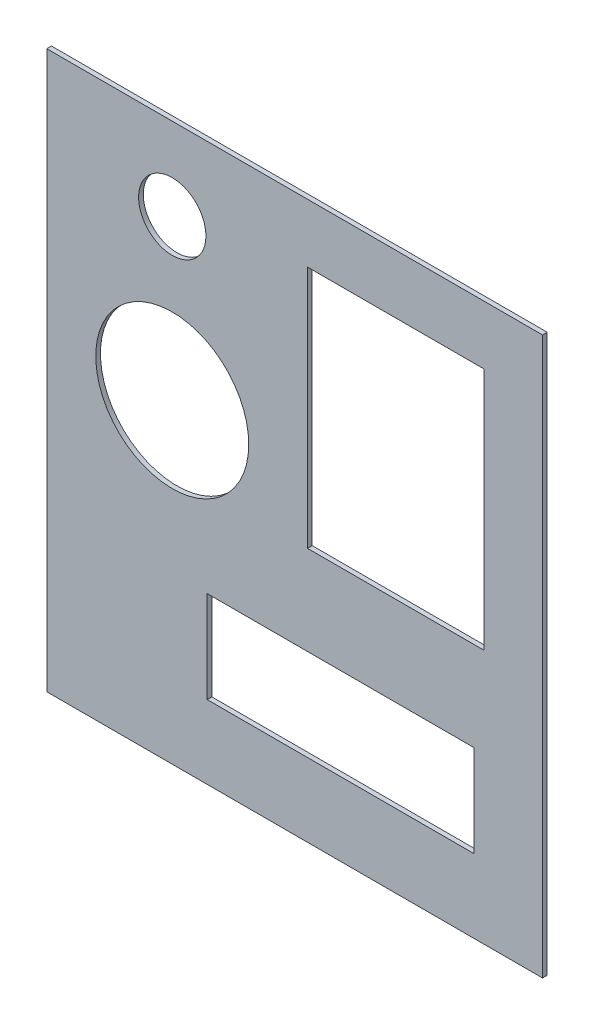
ISO-10303-21;
HEADER;
FILE_DESCRIPTION(('STEP AP214'),'2;1');
FILE_NAME('part.step','',(''),(''),'','','');
FILE_SCHEMA(('AUTOMOTIVE_DESIGN { 1 0 10303 214 1 1 1 1 }'));
ENDSEC;
DATA;
#1=APPLICATION_CONTEXT('core data for automotive mechanical design processes');
#2=APPLICATION_PROTOCOL_DEFINITION('international standard','automotive_design',2000,#1);
#3=PRODUCT_CONTEXT('',#1,'mechanical');
#4=PRODUCT('Part','Part','',(#3));
#5=PRODUCT_RELATED_PRODUCT_CATEGORY('part','',(#4));
#6=PRODUCT_DEFINITION_FORMATION('','',#4);
#7=PRODUCT_DEFINITION_CONTEXT('part definition',#1,'design');
#8=PRODUCT_DEFINITION('design','',#6,#7);
#9=PRODUCT_DEFINITION_SHAPE('','',#8);
#10=(LENGTH_UNIT() NAMED_UNIT(*) SI_UNIT(.MILLI.,.METRE.));
#11=(NAMED_UNIT(*) PLANE_ANGLE_UNIT() SI_UNIT($,.RADIAN.));
#12=(NAMED_UNIT(*) SI_UNIT($,.STERADIAN.) SOLID_ANGLE_UNIT());
#13=UNCERTAINTY_MEASURE_WITH_UNIT(LENGTH_MEASURE(1.E-05),#10,'distance_accuracy_value','');
#14=(GEOMETRIC_REPRESENTATION_CONTEXT(3) GLOBAL_UNCERTAINTY_ASSIGNED_CONTEXT((#13)) GLOBAL_UNIT_ASSIGNED_CONTEXT((#10,
#11,#12)) REPRESENTATION_CONTEXT('',''));
#15=CARTESIAN_POINT('',(0.,0.,0.));
#16=DIRECTION('',(0.,0.,1.));
#17=DIRECTION('',(1.,0.,0.));
#18=AXIS2_PLACEMENT_3D('',#15,#16,#17);
#19=CARTESIAN_POINT('',(-64.29375,-72.23125,1.21412));
#20=DIRECTION('',(-1.,0.,0.));
#21=DIRECTION('',(0.,0.,1.));
#22=AXIS2_PLACEMENT_3D('',#19,#20,#21);
#23=PLANE('',#22);
#24=DIRECTION('',(0.,1.,0.));
#25=VECTOR('',#24,1.);
#26=CARTESIAN_POINT('',(-64.29375,-72.23125,0.));
#27=LINE('',#26,#25);
#28=CARTESIAN_POINT('',(-64.29375,-72.23125,0.));
#29=VERTEX_POINT('',#28);
#30=CARTESIAN_POINT('',(-64.29375,72.23125,0.));
#31=VERTEX_POINT('',#30);
#32=EDGE_CURVE('E240',#29,#31,#27,.T.);
#33=ORIENTED_EDGE('',*,*,#32,.F.);
#34=DIRECTION('',(0.,0.,-1.));
#35=VECTOR('',#34,1.);
#36=CARTESIAN_POINT('',(-64.29375,-72.23125,1.21412));
#37=LINE('',#36,#35);
#38=CARTESIAN_POINT('',(-64.29375,-72.23125,1.21412));
#39=VERTEX_POINT('',#38);
#40=EDGE_CURVE('E11',#39,#29,#37,.T.);
#41=ORIENTED_EDGE('',*,*,#40,.F.);
#42=DIRECTION('',(0.,1.,0.));
#43=VECTOR('',#42,1.);
#44=CARTESIAN_POINT('',(-64.29375,-72.23125,1.21412));
#45=LINE('',#44,#43);
#46=CARTESIAN_POINT('',(-64.29375,72.23125,1.21412));
#47=VERTEX_POINT('',#46);
#48=EDGE_CURVE('E244',#39,#47,#45,.T.);
#49=ORIENTED_EDGE('',*,*,#48,.T.);
#50=DIRECTION('',(0.,0.,-1.));
#51=VECTOR('',#50,1.);
#52=CARTESIAN_POINT('',(-64.29375,72.23125,1.21412));
#53=LINE('',#52,#51);
#54=EDGE_CURVE('E46',#47,#31,#53,.T.);
#55=ORIENTED_EDGE('',*,*,#54,.T.);
#56=EDGE_LOOP('',(#33,#41,#49,#55));
#57=FACE_BOUND('',#56,.T.);
#58=ADVANCED_FACE('F43',(#57),#23,.T.);
#59=CARTESIAN_POINT('',(-64.29375,-72.23125,1.21412));
#60=DIRECTION('',(0.,1.,0.));
#61=DIRECTION('',(0.,0.,1.));
#62=AXIS2_PLACEMENT_3D('',#59,#60,#61);
#63=PLANE('',#62);
#64=DIRECTION('',(1.,0.,0.));
#65=VECTOR('',#64,1.);
#66=CARTESIAN_POINT('',(-64.29375,-72.23125,0.));
#67=LINE('',#66,#65);
#68=CARTESIAN_POINT('',(64.29375,-72.23125,0.));
#69=VERTEX_POINT('',#68);
#70=EDGE_CURVE('E78',#29,#69,#67,.T.);
#71=ORIENTED_EDGE('',*,*,#70,.T.);
#72=DIRECTION('',(0.,0.,-1.));
#73=VECTOR('',#72,1.);
#74=CARTESIAN_POINT('',(64.29375,-72.23125,1.21412));
#75=LINE('',#74,#73);
#76=CARTESIAN_POINT('',(64.29375,-72.23125,1.21412));
#77=VERTEX_POINT('',#76);
#78=EDGE_CURVE('E53',#77,#69,#75,.T.);
#79=ORIENTED_EDGE('',*,*,#78,.F.);
#80=DIRECTION('',(1.,0.,0.));
#81=VECTOR('',#80,1.);
#82=CARTESIAN_POINT('',(-64.29375,-72.23125,1.21412));
#83=LINE('',#82,#81);
#84=EDGE_CURVE('E253',#39,#77,#83,.T.);
#85=ORIENTED_EDGE('',*,*,#84,.F.);
#86=ORIENTED_EDGE('',*,*,#40,.T.);
#87=EDGE_LOOP('',(#71,#79,#85,#86));
#88=FACE_BOUND('',#87,.T.);
#89=ADVANCED_FACE('F282',(#88),#63,.F.);
#90=CARTESIAN_POINT('',(64.29375,-72.23125,1.21412));
#91=DIRECTION('',(-1.,0.,0.));
#92=DIRECTION('',(0.,0.,1.));
#93=AXIS2_PLACEMENT_3D('',#90,#91,#92);
#94=PLANE('',#93);
#95=DIRECTION('',(0.,1.,0.));
#96=VECTOR('',#95,1.);
#97=CARTESIAN_POINT('',(64.29375,-72.23125,0.));
#98=LINE('',#97,#96);
#99=CARTESIAN_POINT('',(64.29375,72.23125,0.));
#100=VERTEX_POINT('',#99);
#101=EDGE_CURVE('E263',#69,#100,#98,.T.);
#102=ORIENTED_EDGE('',*,*,#101,.T.);
#103=DIRECTION('',(0.,0.,-1.));
#104=VECTOR('',#103,1.);
#105=CARTESIAN_POINT('',(64.29375,72.23125,1.21412));
#106=LINE('',#105,#104);
#107=CARTESIAN_POINT('',(64.29375,72.23125,1.21412));
#108=VERTEX_POINT('',#107);
#109=EDGE_CURVE('E270',#108,#100,#106,.T.);
#110=ORIENTED_EDGE('',*,*,#109,.F.);
#111=DIRECTION('',(0.,1.,0.));
#112=VECTOR('',#111,1.);
#113=CARTESIAN_POINT('',(64.29375,-72.23125,1.21412));
#114=LINE('',#113,#112);
#115=EDGE_CURVE('E250',#77,#108,#114,.T.);
#116=ORIENTED_EDGE('',*,*,#115,.F.);
#117=ORIENTED_EDGE('',*,*,#78,.T.);
#118=EDGE_LOOP('',(#102,#110,#116,#117));
#119=FACE_BOUND('',#118,.T.);
#120=ADVANCED_FACE('F280',(#119),#94,.F.);
#121=CARTESIAN_POINT('',(-64.29375,72.23125,1.21412));
#122=DIRECTION('',(0.,1.,0.));
#123=DIRECTION('',(0.,0.,1.));
#124=AXIS2_PLACEMENT_3D('',#121,#122,#123);
#125=PLANE('',#124);
#126=DIRECTION('',(1.,0.,0.));
#127=VECTOR('',#126,1.);
#128=CARTESIAN_POINT('',(-64.29375,72.23125,0.));
#129=LINE('',#128,#127);
#130=EDGE_CURVE('E259',#31,#100,#129,.T.);
#131=ORIENTED_EDGE('',*,*,#130,.F.);
#132=ORIENTED_EDGE('',*,*,#54,.F.);
#133=DIRECTION('',(1.,0.,0.));
#134=VECTOR('',#133,1.);
#135=CARTESIAN_POINT('',(-64.29375,72.23125,1.21412));
#136=LINE('',#135,#134);
#137=EDGE_CURVE('E247',#47,#108,#136,.T.);
#138=ORIENTED_EDGE('',*,*,#137,.T.);
#139=ORIENTED_EDGE('',*,*,#109,.T.);
#140=EDGE_LOOP('',(#131,#132,#138,#139));
#141=FACE_BOUND('',#140,.T.);
#142=ADVANCED_FACE('F275',(#141),#125,.T.);
#143=CARTESIAN_POINT('',(0.,0.,1.21412));
#144=DIRECTION('',(0.,0.,-1.));
#145=DIRECTION('',(-1.,0.,0.));
#146=AXIS2_PLACEMENT_3D('',#143,#144,#145);
#147=PLANE('',#146);
#148=CARTESIAN_POINT('',(-31.75,9.525,1.21412));
#149=DIRECTION('',(0.,0.,1.));
#150=DIRECTION('',(1.,0.,0.));
#151=AXIS2_PLACEMENT_3D('',#148,#149,#150);
#152=CIRCLE('',#151,19.84375);
#153=CARTESIAN_POINT('',(-11.90625,9.525,1.21412));
#154=VERTEX_POINT('',#153);
#155=EDGE_CURVE('E228',#154,#154,#152,.T.);
#156=ORIENTED_EDGE('',*,*,#155,.F.);
#157=EDGE_LOOP('',(#156));
#158=FACE_BOUND('',#157,.T.);
#159=CARTESIAN_POINT('',(-31.75,50.8,1.21412));
#160=DIRECTION('',(0.,0.,1.));
#161=DIRECTION('',(1.,0.,0.));
#162=AXIS2_PLACEMENT_3D('',#159,#160,#161);
#163=CIRCLE('',#162,8.73125);
#164=CARTESIAN_POINT('',(-23.01875,50.8,1.21412));
#165=VERTEX_POINT('',#164);
#166=EDGE_CURVE('E232',#165,#165,#163,.T.);
#167=ORIENTED_EDGE('',*,*,#166,.F.);
#168=EDGE_LOOP('',(#167));
#169=FACE_BOUND('',#168,.T.);
#170=ORIENTED_EDGE('',*,*,#48,.F.);
#171=ORIENTED_EDGE('',*,*,#84,.T.);
#172=ORIENTED_EDGE('',*,*,#115,.T.);
#173=ORIENTED_EDGE('',*,*,#137,.F.);
#174=EDGE_LOOP('',(#170,#171,#172,#173));
#175=FACE_BOUND('',#174,.T.);
#176=DIRECTION('',(0.,-1.,0.));
#177=VECTOR('',#176,1.);
#178=CARTESIAN_POINT('',(3.33375000000001,56.99125,1.21412));
#179=LINE('',#178,#177);
#180=CARTESIAN_POINT('',(3.33375000000001,56.99125,1.21412));
#181=VERTEX_POINT('',#180);
#182=CARTESIAN_POINT('',(3.33375000000001,-6.19125000000001,1.21412));
#183=VERTEX_POINT('',#182);
#184=EDGE_CURVE('E200',#181,#183,#179,.T.);
#185=ORIENTED_EDGE('',*,*,#184,.F.);
#186=DIRECTION('',(-1.,0.,0.));
#187=VECTOR('',#186,1.);
#188=CARTESIAN_POINT('',(49.05375,56.99125,1.21412));
#189=LINE('',#188,#187);
#190=CARTESIAN_POINT('',(49.05375,56.99125,1.21412));
#191=VERTEX_POINT('',#190);
#192=EDGE_CURVE('E184',#191,#181,#189,.T.);
#193=ORIENTED_EDGE('',*,*,#192,.F.);
#194=DIRECTION('',(0.,1.,0.));
#195=VECTOR('',#194,1.);
#196=CARTESIAN_POINT('',(49.05375,-6.19125000000001,1.21412));
#197=LINE('',#196,#195);
#198=CARTESIAN_POINT('',(49.05375,-6.19125000000001,1.21412));
#199=VERTEX_POINT('',#198);
#200=EDGE_CURVE('E190',#199,#191,#197,.T.);
#201=ORIENTED_EDGE('',*,*,#200,.F.);
#202=DIRECTION('',(1.,0.,0.));
#203=VECTOR('',#202,1.);
#204=CARTESIAN_POINT('',(3.33375000000001,-6.19125000000001,1.21412));
#205=LINE('',#204,#203);
#206=EDGE_CURVE('E195',#183,#199,#205,.T.);
#207=ORIENTED_EDGE('',*,*,#206,.F.);
#208=EDGE_LOOP('',(#185,#193,#201,#207));
#209=FACE_BOUND('',#208,.T.);
#210=DIRECTION('',(0.,-1.,0.));
#211=VECTOR('',#210,1.);
#212=CARTESIAN_POINT('',(-22.70125,-29.36875,1.21412));
#213=LINE('',#212,#211);
#214=CARTESIAN_POINT('',(-22.70125,-29.36875,1.21412));
#215=VERTEX_POINT('',#214);
#216=CARTESIAN_POINT('',(-22.70125,-53.18125,1.21412));
#217=VERTEX_POINT('',#216);
#218=EDGE_CURVE('E144',#215,#217,#213,.T.);
#219=ORIENTED_EDGE('',*,*,#218,.F.);
#220=DIRECTION('',(-1.,0.,0.));
#221=VECTOR('',#220,1.);
#222=CARTESIAN_POINT('',(46.51375,-29.36875,1.21412));
#223=LINE('',#222,#221);
#224=CARTESIAN_POINT('',(46.51375,-29.36875,1.21412));
#225=VERTEX_POINT('',#224);
#226=EDGE_CURVE('E181',#225,#215,#223,.T.);
#227=ORIENTED_EDGE('',*,*,#226,.F.);
#228=DIRECTION('',(0.,1.,0.));
#229=VECTOR('',#228,1.);
#230=CARTESIAN_POINT('',(46.51375,-53.18125,1.21412));
#231=LINE('',#230,#229);
#232=CARTESIAN_POINT('',(46.51375,-53.18125,1.21412));
#233=VERTEX_POINT('',#232);
#234=EDGE_CURVE('E150',#233,#225,#231,.T.);
#235=ORIENTED_EDGE('',*,*,#234,.F.);
#236=DIRECTION('',(1.,0.,0.));
#237=VECTOR('',#236,1.);
#238=CARTESIAN_POINT('',(-22.70125,-53.18125,1.21412));
#239=LINE('',#238,#237);
#240=EDGE_CURVE('E149',#217,#233,#239,.T.);
#241=ORIENTED_EDGE('',*,*,#240,.F.);
#242=EDGE_LOOP('',(#219,#227,#235,#241));
#243=FACE_BOUND('',#242,.T.);
#244=ADVANCED_FACE('F284',(#158,#169,#175,#209,#243),#147,.F.);
#245=CARTESIAN_POINT('',(0.,0.,0.));
#246=DIRECTION('',(0.,0.,-1.));
#247=DIRECTION('',(-1.,0.,0.));
#248=AXIS2_PLACEMENT_3D('',#245,#246,#247);
#249=PLANE('',#248);
#250=CARTESIAN_POINT('',(-31.75,9.525,0.));
#251=DIRECTION('',(0.,0.,1.));
#252=DIRECTION('',(1.,0.,0.));
#253=AXIS2_PLACEMENT_3D('',#250,#251,#252);
#254=CIRCLE('',#253,19.84375);
#255=CARTESIAN_POINT('',(-11.90625,9.525,0.));
#256=VERTEX_POINT('',#255);
#257=EDGE_CURVE('E216',#256,#256,#254,.T.);
#258=ORIENTED_EDGE('',*,*,#257,.T.);
#259=EDGE_LOOP('',(#258));
#260=FACE_BOUND('',#259,.T.);
#261=CARTESIAN_POINT('',(-31.75,50.8,0.));
#262=DIRECTION('',(0.,0.,1.));
#263=DIRECTION('',(1.,0.,0.));
#264=AXIS2_PLACEMENT_3D('',#261,#262,#263);
#265=CIRCLE('',#264,8.73125);
#266=CARTESIAN_POINT('',(-23.01875,50.8,0.));
#267=VERTEX_POINT('',#266);
#268=EDGE_CURVE('E236',#267,#267,#265,.T.);
#269=ORIENTED_EDGE('',*,*,#268,.T.);
#270=EDGE_LOOP('',(#269));
#271=FACE_BOUND('',#270,.T.);
#272=ORIENTED_EDGE('',*,*,#32,.T.);
#273=ORIENTED_EDGE('',*,*,#130,.T.);
#274=ORIENTED_EDGE('',*,*,#101,.F.);
#275=ORIENTED_EDGE('',*,*,#70,.F.);
#276=EDGE_LOOP('',(#272,#273,#274,#275));
#277=FACE_BOUND('',#276,.T.);
#278=DIRECTION('',(-1.,0.,0.));
#279=VECTOR('',#278,1.);
#280=CARTESIAN_POINT('',(49.05375,56.99125,0.));
#281=LINE('',#280,#279);
#282=CARTESIAN_POINT('',(49.05375,56.99125,0.));
#283=VERTEX_POINT('',#282);
#284=CARTESIAN_POINT('',(3.33375000000001,56.99125,0.));
#285=VERTEX_POINT('',#284);
#286=EDGE_CURVE('E199',#283,#285,#281,.T.);
#287=ORIENTED_EDGE('',*,*,#286,.T.);
#288=DIRECTION('',(0.,-1.,0.));
#289=VECTOR('',#288,1.);
#290=CARTESIAN_POINT('',(3.33375000000001,56.99125,0.));
#291=LINE('',#290,#289);
#292=CARTESIAN_POINT('',(3.33375000000001,-6.19125000000001,0.));
#293=VERTEX_POINT('',#292);
#294=EDGE_CURVE('E204',#285,#293,#291,.T.);
#295=ORIENTED_EDGE('',*,*,#294,.T.);
#296=DIRECTION('',(1.,0.,0.));
#297=VECTOR('',#296,1.);
#298=CARTESIAN_POINT('',(3.33375000000001,-6.19125000000001,0.));
#299=LINE('',#298,#297);
#300=CARTESIAN_POINT('',(49.05375,-6.19125000000001,0.));
#301=VERTEX_POINT('',#300);
#302=EDGE_CURVE('E208',#293,#301,#299,.T.);
#303=ORIENTED_EDGE('',*,*,#302,.T.);
#304=DIRECTION('',(0.,1.,0.));
#305=VECTOR('',#304,1.);
#306=CARTESIAN_POINT('',(49.05375,-6.19125000000001,0.));
#307=LINE('',#306,#305);
#308=EDGE_CURVE('E212',#301,#283,#307,.T.);
#309=ORIENTED_EDGE('',*,*,#308,.T.);
#310=EDGE_LOOP('',(#287,#295,#303,#309));
#311=FACE_BOUND('',#310,.T.);
#312=DIRECTION('',(-1.,0.,0.));
#313=VECTOR('',#312,1.);
#314=CARTESIAN_POINT('',(46.51375,-29.36875,0.));
#315=LINE('',#314,#313);
#316=CARTESIAN_POINT('',(46.51375,-29.36875,0.));
#317=VERTEX_POINT('',#316);
#318=CARTESIAN_POINT('',(-22.70125,-29.36875,0.));
#319=VERTEX_POINT('',#318);
#320=EDGE_CURVE('E164',#317,#319,#315,.T.);
#321=ORIENTED_EDGE('',*,*,#320,.T.);
#322=DIRECTION('',(0.,-1.,0.));
#323=VECTOR('',#322,1.);
#324=CARTESIAN_POINT('',(-22.70125,-29.36875,0.));
#325=LINE('',#324,#323);
#326=CARTESIAN_POINT('',(-22.70125,-53.18125,0.));
#327=VERTEX_POINT('',#326);
#328=EDGE_CURVE('E141',#319,#327,#325,.T.);
#329=ORIENTED_EDGE('',*,*,#328,.T.);
#330=DIRECTION('',(1.,0.,0.));
#331=VECTOR('',#330,1.);
#332=CARTESIAN_POINT('',(-22.70125,-53.18125,0.));
#333=LINE('',#332,#331);
#334=CARTESIAN_POINT('',(46.51375,-53.18125,0.));
#335=VERTEX_POINT('',#334);
#336=EDGE_CURVE('E153',#327,#335,#333,.T.);
#337=ORIENTED_EDGE('',*,*,#336,.T.);
#338=DIRECTION('',(0.,1.,0.));
#339=VECTOR('',#338,1.);
#340=CARTESIAN_POINT('',(46.51375,-53.18125,0.));
#341=LINE('',#340,#339);
#342=EDGE_CURVE('E160',#335,#317,#341,.T.);
#343=ORIENTED_EDGE('',*,*,#342,.T.);
#344=EDGE_LOOP('',(#321,#329,#337,#343));
#345=FACE_BOUND('',#344,.T.);
#346=ADVANCED_FACE('F163',(#260,#271,#277,#311,#345),#249,.T.);
#347=CARTESIAN_POINT('',(-31.75,50.8,0.));
#348=DIRECTION('',(0.,0.,1.));
#349=DIRECTION('',(1.,0.,0.));
#350=AXIS2_PLACEMENT_3D('',#347,#348,#349);
#351=CYLINDRICAL_SURFACE('',#350,8.73125);
#352=ORIENTED_EDGE('',*,*,#268,.F.);
#353=EDGE_LOOP('',(#352));
#354=FACE_BOUND('',#353,.T.);
#355=ORIENTED_EDGE('',*,*,#166,.T.);
#356=EDGE_LOOP('',(#355));
#357=FACE_BOUND('',#356,.T.);
#358=ADVANCED_FACE('F336',(#354,#357),#351,.F.);
#359=CARTESIAN_POINT('',(-31.75,9.525,0.));
#360=DIRECTION('',(0.,0.,1.));
#361=DIRECTION('',(1.,0.,0.));
#362=AXIS2_PLACEMENT_3D('',#359,#360,#361);
#363=CYLINDRICAL_SURFACE('',#362,19.84375);
#364=ORIENTED_EDGE('',*,*,#257,.F.);
#365=EDGE_LOOP('',(#364));
#366=FACE_BOUND('',#365,.T.);
#367=ORIENTED_EDGE('',*,*,#155,.T.);
#368=EDGE_LOOP('',(#367));
#369=FACE_BOUND('',#368,.T.);
#370=ADVANCED_FACE('F339',(#366,#369),#363,.F.);
#371=CARTESIAN_POINT('',(3.33375000000001,56.99125,-85.0905923486845));
#372=DIRECTION('',(-1.,0.,0.));
#373=DIRECTION('',(0.,0.,1.));
#374=AXIS2_PLACEMENT_3D('',#371,#372,#373);
#375=PLANE('',#374);
#376=ORIENTED_EDGE('',*,*,#294,.F.);
#377=DIRECTION('',(0.,0.,1.));
#378=VECTOR('',#377,1.);
#379=CARTESIAN_POINT('',(3.33375000000001,56.99125,-85.0905923486845));
#380=LINE('',#379,#378);
#381=EDGE_CURVE('E173',#285,#181,#380,.T.);
#382=ORIENTED_EDGE('',*,*,#381,.T.);
#383=ORIENTED_EDGE('',*,*,#184,.T.);
#384=DIRECTION('',(0.,0.,1.));
#385=VECTOR('',#384,1.);
#386=CARTESIAN_POINT('',(3.33375000000001,-6.19125000000001,-85.0905923486845));
#387=LINE('',#386,#385);
#388=EDGE_CURVE('E194',#293,#183,#387,.T.);
#389=ORIENTED_EDGE('',*,*,#388,.F.);
#390=EDGE_LOOP('',(#376,#382,#383,#389));
#391=FACE_BOUND('',#390,.T.);
#392=ADVANCED_FACE('F346',(#391),#375,.F.);
#393=CARTESIAN_POINT('',(49.05375,56.99125,-85.0905923486845));
#394=DIRECTION('',(0.,1.,0.));
#395=DIRECTION('',(0.,0.,1.));
#396=AXIS2_PLACEMENT_3D('',#393,#394,#395);
#397=PLANE('',#396);
#398=ORIENTED_EDGE('',*,*,#286,.F.);
#399=DIRECTION('',(0.,0.,1.));
#400=VECTOR('',#399,1.);
#401=CARTESIAN_POINT('',(49.05375,56.99125,-85.0905923486845));
#402=LINE('',#401,#400);
#403=EDGE_CURVE('E189',#283,#191,#402,.T.);
#404=ORIENTED_EDGE('',*,*,#403,.T.);
#405=ORIENTED_EDGE('',*,*,#192,.T.);
#406=ORIENTED_EDGE('',*,*,#381,.F.);
#407=EDGE_LOOP('',(#398,#404,#405,#406));
#408=FACE_BOUND('',#407,.T.);
#409=ADVANCED_FACE('F367',(#408),#397,.F.);
#410=CARTESIAN_POINT('',(49.05375,-6.19125000000001,-85.0905923486845));
#411=DIRECTION('',(1.,0.,0.));
#412=DIRECTION('',(0.,0.,-1.));
#413=AXIS2_PLACEMENT_3D('',#410,#411,#412);
#414=PLANE('',#413);
#415=ORIENTED_EDGE('',*,*,#308,.F.);
#416=DIRECTION('',(0.,0.,1.));
#417=VECTOR('',#416,1.);
#418=CARTESIAN_POINT('',(49.05375,-6.19125000000001,-85.0905923486845));
#419=LINE('',#418,#417);
#420=EDGE_CURVE('E188',#301,#199,#419,.T.);
#421=ORIENTED_EDGE('',*,*,#420,.T.);
#422=ORIENTED_EDGE('',*,*,#200,.T.);
#423=ORIENTED_EDGE('',*,*,#403,.F.);
#424=EDGE_LOOP('',(#415,#421,#422,#423));
#425=FACE_BOUND('',#424,.T.);
#426=ADVANCED_FACE('F375',(#425),#414,.F.);
#427=CARTESIAN_POINT('',(3.33375000000001,-6.19125000000001,-85.0905923486845));
#428=DIRECTION('',(0.,-1.,0.));
#429=DIRECTION('',(0.,0.,-1.));
#430=AXIS2_PLACEMENT_3D('',#427,#428,#429);
#431=PLANE('',#430);
#432=ORIENTED_EDGE('',*,*,#302,.F.);
#433=ORIENTED_EDGE('',*,*,#388,.T.);
#434=ORIENTED_EDGE('',*,*,#206,.T.);
#435=ORIENTED_EDGE('',*,*,#420,.F.);
#436=EDGE_LOOP('',(#432,#433,#434,#435));
#437=FACE_BOUND('',#436,.T.);
#438=ADVANCED_FACE('F315',(#437),#431,.F.);
#439=CARTESIAN_POINT('',(-22.70125,-29.36875,-87.370208201938));
#440=DIRECTION('',(-1.,0.,0.));
#441=DIRECTION('',(0.,-1.,0.));
#442=AXIS2_PLACEMENT_3D('',#439,#440,#441);
#443=PLANE('',#442);
#444=ORIENTED_EDGE('',*,*,#328,.F.);
#445=DIRECTION('',(0.,0.,1.));
#446=VECTOR('',#445,1.);
#447=CARTESIAN_POINT('',(-22.70125,-29.36875,-87.370208201938));
#448=LINE('',#447,#446);
#449=EDGE_CURVE('E175',#319,#215,#448,.T.);
#450=ORIENTED_EDGE('',*,*,#449,.T.);
#451=ORIENTED_EDGE('',*,*,#218,.T.);
#452=DIRECTION('',(0.,0.,1.));
#453=VECTOR('',#452,1.);
#454=CARTESIAN_POINT('',(-22.70125,-53.18125,-87.370208201938));
#455=LINE('',#454,#453);
#456=EDGE_CURVE('E137',#327,#217,#455,.T.);
#457=ORIENTED_EDGE('',*,*,#456,.F.);
#458=EDGE_LOOP('',(#444,#450,#451,#457));
#459=FACE_BOUND('',#458,.T.);
#460=ADVANCED_FACE('F139',(#459),#443,.F.);
#461=CARTESIAN_POINT('',(46.51375,-29.36875,-87.370208201938));
#462=DIRECTION('',(0.,1.,0.));
#463=DIRECTION('',(0.,0.,1.));
#464=AXIS2_PLACEMENT_3D('',#461,#462,#463);
#465=PLANE('',#464);
#466=ORIENTED_EDGE('',*,*,#320,.F.);
#467=DIRECTION('',(0.,0.,1.));
#468=VECTOR('',#467,1.);
#469=CARTESIAN_POINT('',(46.51375,-29.36875,-87.370208201938));
#470=LINE('',#469,#468);
#471=EDGE_CURVE('E178',#317,#225,#470,.T.);
#472=ORIENTED_EDGE('',*,*,#471,.T.);
#473=ORIENTED_EDGE('',*,*,#226,.T.);
#474=ORIENTED_EDGE('',*,*,#449,.F.);
#475=EDGE_LOOP('',(#466,#472,#473,#474));
#476=FACE_BOUND('',#475,.T.);
#477=ADVANCED_FACE('F307',(#476),#465,.F.);
#478=CARTESIAN_POINT('',(46.51375,-53.18125,-87.370208201938));
#479=DIRECTION('',(1.,0.,0.));
#480=DIRECTION('',(0.,0.,-1.));
#481=AXIS2_PLACEMENT_3D('',#478,#479,#480);
#482=PLANE('',#481);
#483=ORIENTED_EDGE('',*,*,#342,.F.);
#484=DIRECTION('',(0.,0.,1.));
#485=VECTOR('',#484,1.);
#486=CARTESIAN_POINT('',(46.51375,-53.18125,-87.370208201938));
#487=LINE('',#486,#485);
#488=EDGE_CURVE('E155',#335,#233,#487,.T.);
#489=ORIENTED_EDGE('',*,*,#488,.T.);
#490=ORIENTED_EDGE('',*,*,#234,.T.);
#491=ORIENTED_EDGE('',*,*,#471,.F.);
#492=EDGE_LOOP('',(#483,#489,#490,#491));
#493=FACE_BOUND('',#492,.T.);
#494=ADVANCED_FACE('F305',(#493),#482,.F.);
#495=CARTESIAN_POINT('',(-22.70125,-53.18125,-87.370208201938));
#496=DIRECTION('',(0.,-1.,0.));
#497=DIRECTION('',(1.,0.,0.));
#498=AXIS2_PLACEMENT_3D('',#495,#496,#497);
#499=PLANE('',#498);
#500=ORIENTED_EDGE('',*,*,#336,.F.);
#501=ORIENTED_EDGE('',*,*,#456,.T.);
#502=ORIENTED_EDGE('',*,*,#240,.T.);
#503=ORIENTED_EDGE('',*,*,#488,.F.);
#504=EDGE_LOOP('',(#500,#501,#502,#503));
#505=FACE_BOUND('',#504,.T.);
#506=ADVANCED_FACE('F154',(#505),#499,.F.);
#507=CLOSED_SHELL('',(#58,#89,#120,#142,#244,#346,#358,#370,#392,#409,#426,#438,#460,#477,#494,#506));
#508=MANIFOLD_SOLID_BREP('B2',#507);
#509=ADVANCED_BREP_SHAPE_REPRESENTATION('',(#18,#508),#14);
#510=SHAPE_DEFINITION_REPRESENTATION(#9,#509);
ENDSEC;
END-ISO-10303-21;
